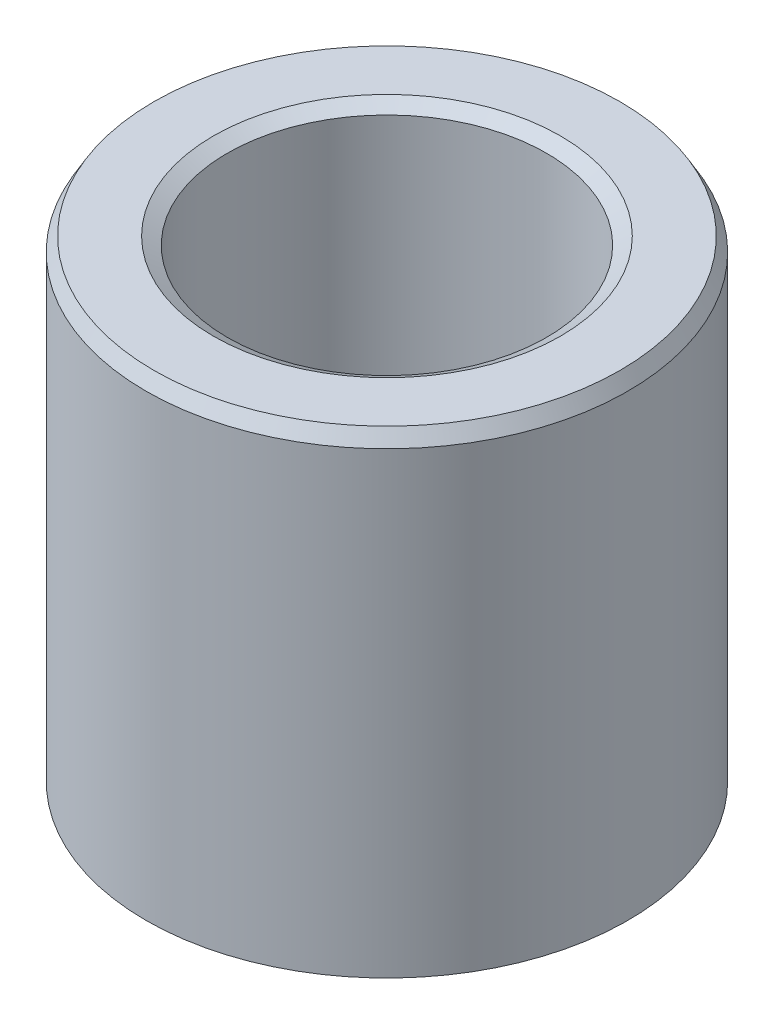
ISO-10303-21;
HEADER;
FILE_DESCRIPTION(('STEP AP214'),'2;1');
FILE_NAME('part.step','',(''),(''),'','','');
FILE_SCHEMA(('AUTOMOTIVE_DESIGN { 1 0 10303 214 1 1 1 1 }'));
ENDSEC;
DATA;
#1=APPLICATION_CONTEXT('core data for automotive mechanical design processes');
#2=APPLICATION_PROTOCOL_DEFINITION('international standard','automotive_design',2000,#1);
#3=PRODUCT_CONTEXT('',#1,'mechanical');
#4=PRODUCT('Part','Part','',(#3));
#5=PRODUCT_RELATED_PRODUCT_CATEGORY('part','',(#4));
#6=PRODUCT_DEFINITION_FORMATION('','',#4);
#7=PRODUCT_DEFINITION_CONTEXT('part definition',#1,'design');
#8=PRODUCT_DEFINITION('design','',#6,#7);
#9=PRODUCT_DEFINITION_SHAPE('','',#8);
#10=(LENGTH_UNIT() NAMED_UNIT(*) SI_UNIT(.MILLI.,.METRE.));
#11=(NAMED_UNIT(*) PLANE_ANGLE_UNIT() SI_UNIT($,.RADIAN.));
#12=(NAMED_UNIT(*) SI_UNIT($,.STERADIAN.) SOLID_ANGLE_UNIT());
#13=UNCERTAINTY_MEASURE_WITH_UNIT(LENGTH_MEASURE(1.E-05),#10,'distance_accuracy_value','');
#14=(GEOMETRIC_REPRESENTATION_CONTEXT(3) GLOBAL_UNCERTAINTY_ASSIGNED_CONTEXT((#13)) GLOBAL_UNIT_ASSIGNED_CONTEXT((#10,
#11,#12)) REPRESENTATION_CONTEXT('',''));
#15=CARTESIAN_POINT('',(0.,0.,0.));
#16=DIRECTION('',(0.,0.,1.));
#17=DIRECTION('',(1.,0.,0.));
#18=AXIS2_PLACEMENT_3D('',#15,#16,#17);
#19=CARTESIAN_POINT('',(0.,109.63421193628,0.));
#20=DIRECTION('',(0.,-1.,0.));
#21=DIRECTION('',(0.,0.,-1.));
#22=AXIS2_PLACEMENT_3D('',#19,#20,#21);
#23=CYLINDRICAL_SURFACE('',#22,55.);
#24=CARTESIAN_POINT('',(0.,1.83061919803762,0.));
#25=DIRECTION('',(0.,1.,0.));
#26=DIRECTION('',(0.,0.,1.));
#27=AXIS2_PLACEMENT_3D('',#24,#25,#26);
#28=CIRCLE('',#27,55.);
#29=CARTESIAN_POINT('',(0.,1.83061919803762,55.));
#30=VERTEX_POINT('',#29);
#31=EDGE_CURVE('E10',#30,#30,#28,.T.);
#32=ORIENTED_EDGE('',*,*,#31,.T.);
#33=EDGE_LOOP('',(#32));
#34=FACE_BOUND('',#33,.T.);
#35=CARTESIAN_POINT('',(0.,106.463486475968,0.));
#36=DIRECTION('',(0.,1.,0.));
#37=DIRECTION('',(0.,0.,1.));
#38=AXIS2_PLACEMENT_3D('',#35,#36,#37);
#39=CIRCLE('',#38,55.);
#40=CARTESIAN_POINT('',(0.,106.463486475968,55.));
#41=VERTEX_POINT('',#40);
#42=EDGE_CURVE('E50',#41,#41,#39,.F.);
#43=ORIENTED_EDGE('',*,*,#42,.T.);
#44=EDGE_LOOP('',(#43));
#45=FACE_BOUND('',#44,.T.);
#46=ADVANCED_FACE('F39',(#34,#45),#23,.T.);
#47=CARTESIAN_POINT('',(0.,109.63421193628,0.));
#48=DIRECTION('',(0.,1.,0.));
#49=DIRECTION('',(0.,0.,1.));
#50=AXIS2_PLACEMENT_3D('',#47,#48,#49);
#51=PLANE('',#50);
#52=CARTESIAN_POINT('',(0.,109.63421193628,0.));
#53=DIRECTION('',(0.,1.,0.));
#54=DIRECTION('',(0.,0.,1.));
#55=AXIS2_PLACEMENT_3D('',#52,#53,#54);
#56=CIRCLE('',#55,39.6068982154008);
#57=CARTESIAN_POINT('',(0.,109.63421193628,39.6068982154008));
#58=VERTEX_POINT('',#57);
#59=EDGE_CURVE('E58',#58,#58,#56,.F.);
#60=ORIENTED_EDGE('',*,*,#59,.T.);
#61=EDGE_LOOP('',(#60));
#62=FACE_BOUND('',#61,.T.);
#63=CARTESIAN_POINT('',(0.,109.63421193628,0.));
#64=DIRECTION('',(0.,1.,0.));
#65=DIRECTION('',(0.,0.,1.));
#66=AXIS2_PLACEMENT_3D('',#63,#64,#65);
#67=CIRCLE('',#66,53.1693808019624);
#68=CARTESIAN_POINT('',(0.,109.63421193628,53.1693808019624));
#69=VERTEX_POINT('',#68);
#70=EDGE_CURVE('E61',#69,#69,#67,.T.);
#71=ORIENTED_EDGE('',*,*,#70,.T.);
#72=EDGE_LOOP('',(#71));
#73=FACE_BOUND('',#72,.T.);
#74=ADVANCED_FACE('F88',(#62,#73),#51,.T.);
#75=CARTESIAN_POINT('',(0.,0.,0.));
#76=DIRECTION('',(0.,1.,0.));
#77=DIRECTION('',(0.,0.,1.));
#78=AXIS2_PLACEMENT_3D('',#75,#76,#77);
#79=PLANE('',#78);
#80=CARTESIAN_POINT('',(0.,0.,0.));
#81=DIRECTION('',(0.,1.,0.));
#82=DIRECTION('',(0.,0.,1.));
#83=AXIS2_PLACEMENT_3D('',#80,#81,#82);
#84=CIRCLE('',#83,38.2667919531262);
#85=CARTESIAN_POINT('',(0.,0.,38.2667919531262));
#86=VERTEX_POINT('',#85);
#87=EDGE_CURVE('E51',#86,#86,#84,.T.);
#88=ORIENTED_EDGE('',*,*,#87,.T.);
#89=EDGE_LOOP('',(#88));
#90=FACE_BOUND('',#89,.T.);
#91=CARTESIAN_POINT('',(0.,0.,0.));
#92=DIRECTION('',(0.,1.,0.));
#93=DIRECTION('',(0.,0.,1.));
#94=AXIS2_PLACEMENT_3D('',#91,#92,#93);
#95=CIRCLE('',#94,51.8292745396878);
#96=CARTESIAN_POINT('',(0.,0.,51.8292745396878));
#97=VERTEX_POINT('',#96);
#98=EDGE_CURVE('E54',#97,#97,#95,.F.);
#99=ORIENTED_EDGE('',*,*,#98,.T.);
#100=EDGE_LOOP('',(#99));
#101=FACE_BOUND('',#100,.T.);
#102=ADVANCED_FACE('F83',(#90,#101),#79,.F.);
#103=CARTESIAN_POINT('',(0.,109.63421193628,0.));
#104=DIRECTION('',(0.,-1.,0.));
#105=DIRECTION('',(0.,0.,-1.));
#106=AXIS2_PLACEMENT_3D('',#103,#104,#105);
#107=CYLINDRICAL_SURFACE('',#106,36.4361727550886);
#108=CARTESIAN_POINT('',(0.,107.803592738243,0.));
#109=DIRECTION('',(0.,1.,0.));
#110=DIRECTION('',(0.,0.,1.));
#111=AXIS2_PLACEMENT_3D('',#108,#109,#110);
#112=CIRCLE('',#111,36.4361727550886);
#113=CARTESIAN_POINT('',(0.,107.803592738243,36.4361727550886));
#114=VERTEX_POINT('',#113);
#115=EDGE_CURVE('E67',#114,#114,#112,.T.);
#116=ORIENTED_EDGE('',*,*,#115,.T.);
#117=EDGE_LOOP('',(#116));
#118=FACE_BOUND('',#117,.T.);
#119=CARTESIAN_POINT('',(0.,3.17072546031219,0.));
#120=DIRECTION('',(0.,1.,0.));
#121=DIRECTION('',(0.,0.,1.));
#122=AXIS2_PLACEMENT_3D('',#119,#120,#121);
#123=CIRCLE('',#122,36.4361727550886);
#124=CARTESIAN_POINT('',(0.,3.17072546031219,36.4361727550886));
#125=VERTEX_POINT('',#124);
#126=EDGE_CURVE('E69',#125,#125,#123,.F.);
#127=ORIENTED_EDGE('',*,*,#126,.T.);
#128=EDGE_LOOP('',(#127));
#129=FACE_BOUND('',#128,.T.);
#130=ADVANCED_FACE('F71',(#118,#129),#107,.F.);
#131=CARTESIAN_POINT('',(0.,107.803592738243,0.));
#132=DIRECTION('',(0.,1.,0.));
#133=DIRECTION('',(0.,0.,1.));
#134=AXIS2_PLACEMENT_3D('',#131,#132,#133);
#135=CONICAL_SURFACE('',#134,36.4361727550886,1.0471975511966);
#136=ORIENTED_EDGE('',*,*,#59,.F.);
#137=EDGE_LOOP('',(#136));
#138=FACE_BOUND('',#137,.T.);
#139=ORIENTED_EDGE('',*,*,#115,.F.);
#140=EDGE_LOOP('',(#139));
#141=FACE_BOUND('',#140,.T.);
#142=ADVANCED_FACE('F77',(#138,#141),#135,.F.);
#143=CARTESIAN_POINT('',(0.,0.,0.));
#144=DIRECTION('',(0.,-1.,0.));
#145=DIRECTION('',(0.,0.,-1.));
#146=AXIS2_PLACEMENT_3D('',#143,#144,#145);
#147=CONICAL_SURFACE('',#146,38.2667919531262,0.523598775598293);
#148=ORIENTED_EDGE('',*,*,#126,.F.);
#149=EDGE_LOOP('',(#148));
#150=FACE_BOUND('',#149,.T.);
#151=ORIENTED_EDGE('',*,*,#87,.F.);
#152=EDGE_LOOP('',(#151));
#153=FACE_BOUND('',#152,.T.);
#154=ADVANCED_FACE('F73',(#150,#153),#147,.F.);
#155=CARTESIAN_POINT('',(0.,1.83061919803762,0.));
#156=DIRECTION('',(0.,1.,0.));
#157=DIRECTION('',(0.,0.,1.));
#158=AXIS2_PLACEMENT_3D('',#155,#156,#157);
#159=CONICAL_SURFACE('',#158,55.,1.0471975511966);
#160=ORIENTED_EDGE('',*,*,#98,.F.);
#161=EDGE_LOOP('',(#160));
#162=FACE_BOUND('',#161,.T.);
#163=ORIENTED_EDGE('',*,*,#31,.F.);
#164=EDGE_LOOP('',(#163));
#165=FACE_BOUND('',#164,.T.);
#166=ADVANCED_FACE('F76',(#162,#165),#159,.T.);
#167=CARTESIAN_POINT('',(0.,109.63421193628,0.));
#168=DIRECTION('',(0.,-1.,0.));
#169=DIRECTION('',(0.,0.,-1.));
#170=AXIS2_PLACEMENT_3D('',#167,#168,#169);
#171=CONICAL_SURFACE('',#170,53.1693808019624,0.523598775598287);
#172=ORIENTED_EDGE('',*,*,#42,.F.);
#173=EDGE_LOOP('',(#172));
#174=FACE_BOUND('',#173,.T.);
#175=ORIENTED_EDGE('',*,*,#70,.F.);
#176=EDGE_LOOP('',(#175));
#177=FACE_BOUND('',#176,.T.);
#178=ADVANCED_FACE('F45',(#174,#177),#171,.T.);
#179=CLOSED_SHELL('',(#46,#74,#102,#130,#142,#154,#166,#178));
#180=MANIFOLD_SOLID_BREP('B2',#179);
#181=ADVANCED_BREP_SHAPE_REPRESENTATION('',(#18,#180),#14);
#182=SHAPE_DEFINITION_REPRESENTATION(#9,#181);
ENDSEC;
END-ISO-10303-21;
